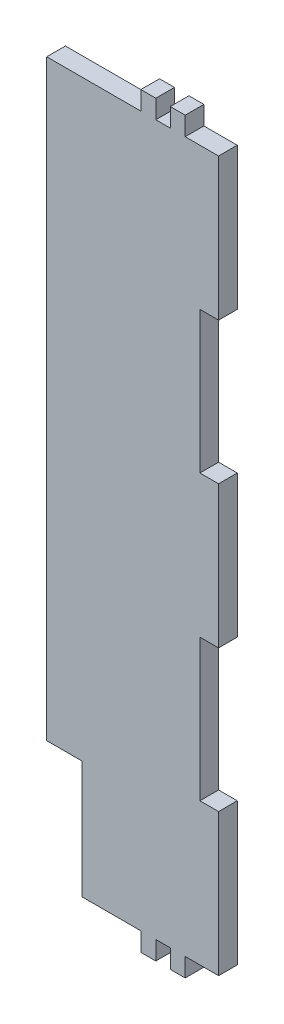
ISO-10303-21;
HEADER;
FILE_DESCRIPTION(('STEP AP214'),'2;1');
FILE_NAME('part.step','',(''),(''),'','','');
FILE_SCHEMA(('AUTOMOTIVE_DESIGN { 1 0 10303 214 1 1 1 1 }'));
ENDSEC;
DATA;
#1=APPLICATION_CONTEXT('core data for automotive mechanical design processes');
#2=APPLICATION_PROTOCOL_DEFINITION('international standard','automotive_design',2000,#1);
#3=PRODUCT_CONTEXT('',#1,'mechanical');
#4=PRODUCT('Part','Part','',(#3));
#5=PRODUCT_RELATED_PRODUCT_CATEGORY('part','',(#4));
#6=PRODUCT_DEFINITION_FORMATION('','',#4);
#7=PRODUCT_DEFINITION_CONTEXT('part definition',#1,'design');
#8=PRODUCT_DEFINITION('design','',#6,#7);
#9=PRODUCT_DEFINITION_SHAPE('','',#8);
#10=(LENGTH_UNIT() NAMED_UNIT(*) SI_UNIT(.MILLI.,.METRE.));
#11=(NAMED_UNIT(*) PLANE_ANGLE_UNIT() SI_UNIT($,.RADIAN.));
#12=(NAMED_UNIT(*) SI_UNIT($,.STERADIAN.) SOLID_ANGLE_UNIT());
#13=UNCERTAINTY_MEASURE_WITH_UNIT(LENGTH_MEASURE(1.E-05),#10,'distance_accuracy_value','');
#14=(GEOMETRIC_REPRESENTATION_CONTEXT(3) GLOBAL_UNCERTAINTY_ASSIGNED_CONTEXT((#13)) GLOBAL_UNIT_ASSIGNED_CONTEXT((#10,
#11,#12)) REPRESENTATION_CONTEXT('',''));
#15=CARTESIAN_POINT('',(0.,0.,0.));
#16=DIRECTION('',(0.,0.,1.));
#17=DIRECTION('',(1.,0.,0.));
#18=AXIS2_PLACEMENT_3D('',#15,#16,#17);
#19=CARTESIAN_POINT('',(-39.54064,-80.70314,-260.737830047496));
#20=DIRECTION('',(0.,-1.,0.));
#21=DIRECTION('',(0.,0.,-1.));
#22=AXIS2_PLACEMENT_3D('',#19,#20,#21);
#23=PLANE('',#22);
#24=DIRECTION('',(-1.,0.,0.));
#25=VECTOR('',#24,1.);
#26=CARTESIAN_POINT('',(-39.54064,-80.70314,0.));
#27=LINE('',#26,#25);
#28=CARTESIAN_POINT('',(-27.54064,-80.70314,0.));
#29=VERTEX_POINT('',#28);
#30=CARTESIAN_POINT('',(-39.54064,-80.70314,0.));
#31=VERTEX_POINT('',#30);
#32=EDGE_CURVE('E46',#29,#31,#27,.T.);
#33=ORIENTED_EDGE('',*,*,#32,.F.);
#34=DIRECTION('',(0.,0.,1.));
#35=VECTOR('',#34,1.);
#36=CARTESIAN_POINT('',(-27.54064,-80.70314,-260.737830047496));
#37=LINE('',#36,#35);
#38=CARTESIAN_POINT('',(-27.54064,-80.70314,6.35));
#39=VERTEX_POINT('',#38);
#40=EDGE_CURVE('E233',#29,#39,#37,.T.);
#41=ORIENTED_EDGE('',*,*,#40,.T.);
#42=DIRECTION('',(1.,0.,0.));
#43=VECTOR('',#42,1.);
#44=CARTESIAN_POINT('',(-39.54064,-80.70314,6.35));
#45=LINE('',#44,#43);
#46=CARTESIAN_POINT('',(-39.54064,-80.70314,6.35));
#47=VERTEX_POINT('',#46);
#48=EDGE_CURVE('E237',#47,#39,#45,.T.);
#49=ORIENTED_EDGE('',*,*,#48,.F.);
#50=DIRECTION('',(0.,0.,1.));
#51=VECTOR('',#50,1.);
#52=CARTESIAN_POINT('',(-39.54064,-80.70314,-260.737830047496));
#53=LINE('',#52,#51);
#54=EDGE_CURVE('E338',#31,#47,#53,.T.);
#55=ORIENTED_EDGE('',*,*,#54,.F.);
#56=EDGE_LOOP('',(#33,#41,#49,#55));
#57=FACE_BOUND('',#56,.T.);
#58=ADVANCED_FACE('F38',(#57),#23,.T.);
#59=CARTESIAN_POINT('',(-39.54064,120.70314,-260.737830047496));
#60=DIRECTION('',(-1.,0.,0.));
#61=DIRECTION('',(0.,-1.,0.));
#62=AXIS2_PLACEMENT_3D('',#59,#60,#61);
#63=PLANE('',#62);
#64=DIRECTION('',(0.,1.,0.));
#65=VECTOR('',#64,1.);
#66=CARTESIAN_POINT('',(-39.54064,120.70314,0.));
#67=LINE('',#66,#65);
#68=CARTESIAN_POINT('',(-39.54064,120.70314,0.));
#69=VERTEX_POINT('',#68);
#70=EDGE_CURVE('E542',#31,#69,#67,.T.);
#71=ORIENTED_EDGE('',*,*,#70,.F.);
#72=ORIENTED_EDGE('',*,*,#54,.T.);
#73=DIRECTION('',(0.,-1.,0.));
#74=VECTOR('',#73,1.);
#75=CARTESIAN_POINT('',(-39.54064,120.70314,6.35));
#76=LINE('',#75,#74);
#77=CARTESIAN_POINT('',(-39.54064,120.70314,6.35));
#78=VERTEX_POINT('',#77);
#79=EDGE_CURVE('E242',#78,#47,#76,.T.);
#80=ORIENTED_EDGE('',*,*,#79,.F.);
#81=DIRECTION('',(0.,0.,1.));
#82=VECTOR('',#81,1.);
#83=CARTESIAN_POINT('',(-39.54064,120.70314,-260.737830047496));
#84=LINE('',#83,#82);
#85=EDGE_CURVE('E341',#69,#78,#84,.T.);
#86=ORIENTED_EDGE('',*,*,#85,.F.);
#87=EDGE_LOOP('',(#71,#72,#80,#86));
#88=FACE_BOUND('',#87,.T.);
#89=ADVANCED_FACE('F541',(#88),#63,.T.);
#90=CARTESIAN_POINT('',(-7.54063999999999,120.70314,-260.737830047496));
#91=DIRECTION('',(0.,1.,0.));
#92=DIRECTION('',(-1.,0.,0.));
#93=AXIS2_PLACEMENT_3D('',#90,#91,#92);
#94=PLANE('',#93);
#95=DIRECTION('',(1.,0.,0.));
#96=VECTOR('',#95,1.);
#97=CARTESIAN_POINT('',(-7.54063999999999,120.70314,0.));
#98=LINE('',#97,#96);
#99=CARTESIAN_POINT('',(-7.54063999999999,120.70314,0.));
#100=VERTEX_POINT('',#99);
#101=EDGE_CURVE('E544',#69,#100,#98,.T.);
#102=ORIENTED_EDGE('',*,*,#101,.F.);
#103=ORIENTED_EDGE('',*,*,#85,.T.);
#104=DIRECTION('',(-1.,0.,0.));
#105=VECTOR('',#104,1.);
#106=CARTESIAN_POINT('',(-7.54063999999999,120.70314,6.35));
#107=LINE('',#106,#105);
#108=CARTESIAN_POINT('',(-7.54063999999999,120.70314,6.35));
#109=VERTEX_POINT('',#108);
#110=EDGE_CURVE('E335',#109,#78,#107,.T.);
#111=ORIENTED_EDGE('',*,*,#110,.F.);
#112=DIRECTION('',(0.,0.,1.));
#113=VECTOR('',#112,1.);
#114=CARTESIAN_POINT('',(-7.54063999999999,120.70314,-260.737830047496));
#115=LINE('',#114,#113);
#116=EDGE_CURVE('E343',#100,#109,#115,.T.);
#117=ORIENTED_EDGE('',*,*,#116,.F.);
#118=EDGE_LOOP('',(#102,#103,#111,#117));
#119=FACE_BOUND('',#118,.T.);
#120=ADVANCED_FACE('F591',(#119),#94,.T.);
#121=CARTESIAN_POINT('',(-7.54063999999999,127.05314,-260.737830047496));
#122=DIRECTION('',(-1.,0.,0.));
#123=DIRECTION('',(0.,0.,1.));
#124=AXIS2_PLACEMENT_3D('',#121,#122,#123);
#125=PLANE('',#124);
#126=DIRECTION('',(0.,1.,0.));
#127=VECTOR('',#126,1.);
#128=CARTESIAN_POINT('',(-7.54063999999999,127.05314,0.));
#129=LINE('',#128,#127);
#130=CARTESIAN_POINT('',(-7.54063999999999,127.05314,0.));
#131=VERTEX_POINT('',#130);
#132=EDGE_CURVE('E545',#100,#131,#129,.T.);
#133=ORIENTED_EDGE('',*,*,#132,.F.);
#134=ORIENTED_EDGE('',*,*,#116,.T.);
#135=DIRECTION('',(0.,-1.,0.));
#136=VECTOR('',#135,1.);
#137=CARTESIAN_POINT('',(-7.54063999999999,127.05314,6.35));
#138=LINE('',#137,#136);
#139=CARTESIAN_POINT('',(-7.54063999999999,127.05314,6.35));
#140=VERTEX_POINT('',#139);
#141=EDGE_CURVE('E332',#140,#109,#138,.T.);
#142=ORIENTED_EDGE('',*,*,#141,.F.);
#143=DIRECTION('',(0.,0.,1.));
#144=VECTOR('',#143,1.);
#145=CARTESIAN_POINT('',(-7.54063999999999,127.05314,-260.737830047496));
#146=LINE('',#145,#144);
#147=EDGE_CURVE('E345',#131,#140,#146,.T.);
#148=ORIENTED_EDGE('',*,*,#147,.F.);
#149=EDGE_LOOP('',(#133,#134,#142,#148));
#150=FACE_BOUND('',#149,.T.);
#151=ADVANCED_FACE('F534',(#150),#125,.T.);
#152=CARTESIAN_POINT('',(-2.45935999999999,127.05314,-260.737830047496));
#153=DIRECTION('',(0.,1.,0.));
#154=DIRECTION('',(-1.,0.,0.));
#155=AXIS2_PLACEMENT_3D('',#152,#153,#154);
#156=PLANE('',#155);
#157=DIRECTION('',(1.,0.,0.));
#158=VECTOR('',#157,1.);
#159=CARTESIAN_POINT('',(-2.45935999999999,127.05314,0.));
#160=LINE('',#159,#158);
#161=CARTESIAN_POINT('',(-2.45935999999999,127.05314,0.));
#162=VERTEX_POINT('',#161);
#163=EDGE_CURVE('E531',#131,#162,#160,.T.);
#164=ORIENTED_EDGE('',*,*,#163,.F.);
#165=ORIENTED_EDGE('',*,*,#147,.T.);
#166=DIRECTION('',(-1.,0.,0.));
#167=VECTOR('',#166,1.);
#168=CARTESIAN_POINT('',(-2.45935999999999,127.05314,6.35));
#169=LINE('',#168,#167);
#170=CARTESIAN_POINT('',(-2.45935999999999,127.05314,6.35));
#171=VERTEX_POINT('',#170);
#172=EDGE_CURVE('E329',#171,#140,#169,.T.);
#173=ORIENTED_EDGE('',*,*,#172,.F.);
#174=DIRECTION('',(0.,0.,1.));
#175=VECTOR('',#174,1.);
#176=CARTESIAN_POINT('',(-2.45935999999999,127.05314,-260.737830047496));
#177=LINE('',#176,#175);
#178=EDGE_CURVE('E347',#162,#171,#177,.T.);
#179=ORIENTED_EDGE('',*,*,#178,.F.);
#180=EDGE_LOOP('',(#164,#165,#173,#179));
#181=FACE_BOUND('',#180,.T.);
#182=ADVANCED_FACE('F528',(#181),#156,.T.);
#183=CARTESIAN_POINT('',(-2.45935999999999,120.70314,-260.737830047496));
#184=DIRECTION('',(1.,0.,0.));
#185=DIRECTION('',(0.,0.,-1.));
#186=AXIS2_PLACEMENT_3D('',#183,#184,#185);
#187=PLANE('',#186);
#188=DIRECTION('',(0.,-1.,0.));
#189=VECTOR('',#188,1.);
#190=CARTESIAN_POINT('',(-2.45935999999999,120.70314,0.));
#191=LINE('',#190,#189);
#192=CARTESIAN_POINT('',(-2.45935999999999,120.70314,0.));
#193=VERTEX_POINT('',#192);
#194=EDGE_CURVE('E525',#162,#193,#191,.T.);
#195=ORIENTED_EDGE('',*,*,#194,.F.);
#196=ORIENTED_EDGE('',*,*,#178,.T.);
#197=DIRECTION('',(0.,1.,0.));
#198=VECTOR('',#197,1.);
#199=CARTESIAN_POINT('',(-2.45935999999999,120.70314,6.35));
#200=LINE('',#199,#198);
#201=CARTESIAN_POINT('',(-2.45935999999999,120.70314,6.35));
#202=VERTEX_POINT('',#201);
#203=EDGE_CURVE('E326',#202,#171,#200,.T.);
#204=ORIENTED_EDGE('',*,*,#203,.F.);
#205=DIRECTION('',(0.,0.,1.));
#206=VECTOR('',#205,1.);
#207=CARTESIAN_POINT('',(-2.45935999999999,120.70314,-260.737830047496));
#208=LINE('',#207,#206);
#209=EDGE_CURVE('E349',#193,#202,#208,.T.);
#210=ORIENTED_EDGE('',*,*,#209,.F.);
#211=EDGE_LOOP('',(#195,#196,#204,#210));
#212=FACE_BOUND('',#211,.T.);
#213=ADVANCED_FACE('F523',(#212),#187,.T.);
#214=CARTESIAN_POINT('',(2.45936000000001,120.70314,-260.737830047496));
#215=DIRECTION('',(0.,1.,0.));
#216=DIRECTION('',(0.,0.,1.));
#217=AXIS2_PLACEMENT_3D('',#214,#215,#216);
#218=PLANE('',#217);
#219=DIRECTION('',(1.,0.,0.));
#220=VECTOR('',#219,1.);
#221=CARTESIAN_POINT('',(2.45936000000001,120.70314,0.));
#222=LINE('',#221,#220);
#223=CARTESIAN_POINT('',(2.45936000000001,120.70314,0.));
#224=VERTEX_POINT('',#223);
#225=EDGE_CURVE('E551',#193,#224,#222,.T.);
#226=ORIENTED_EDGE('',*,*,#225,.F.);
#227=ORIENTED_EDGE('',*,*,#209,.T.);
#228=DIRECTION('',(-1.,0.,0.));
#229=VECTOR('',#228,1.);
#230=CARTESIAN_POINT('',(2.45936000000001,120.70314,6.35));
#231=LINE('',#230,#229);
#232=CARTESIAN_POINT('',(2.45936000000001,120.70314,6.35));
#233=VERTEX_POINT('',#232);
#234=EDGE_CURVE('E323',#233,#202,#231,.T.);
#235=ORIENTED_EDGE('',*,*,#234,.F.);
#236=DIRECTION('',(0.,0.,1.));
#237=VECTOR('',#236,1.);
#238=CARTESIAN_POINT('',(2.45936000000001,120.70314,-260.737830047496));
#239=LINE('',#238,#237);
#240=EDGE_CURVE('E351',#224,#233,#239,.T.);
#241=ORIENTED_EDGE('',*,*,#240,.F.);
#242=EDGE_LOOP('',(#226,#227,#235,#241));
#243=FACE_BOUND('',#242,.T.);
#244=ADVANCED_FACE('F517',(#243),#218,.T.);
#245=CARTESIAN_POINT('',(2.45936000000001,127.05314,-260.737830047496));
#246=DIRECTION('',(-1.,0.,0.));
#247=DIRECTION('',(0.,0.,1.));
#248=AXIS2_PLACEMENT_3D('',#245,#246,#247);
#249=PLANE('',#248);
#250=DIRECTION('',(0.,1.,0.));
#251=VECTOR('',#250,1.);
#252=CARTESIAN_POINT('',(2.45936000000001,127.05314,0.));
#253=LINE('',#252,#251);
#254=CARTESIAN_POINT('',(2.45936000000001,127.05314,0.));
#255=VERTEX_POINT('',#254);
#256=EDGE_CURVE('E514',#224,#255,#253,.T.);
#257=ORIENTED_EDGE('',*,*,#256,.F.);
#258=ORIENTED_EDGE('',*,*,#240,.T.);
#259=DIRECTION('',(0.,-1.,0.));
#260=VECTOR('',#259,1.);
#261=CARTESIAN_POINT('',(2.45936000000001,127.05314,6.35));
#262=LINE('',#261,#260);
#263=CARTESIAN_POINT('',(2.45936000000001,127.05314,6.35));
#264=VERTEX_POINT('',#263);
#265=EDGE_CURVE('E320',#264,#233,#262,.T.);
#266=ORIENTED_EDGE('',*,*,#265,.F.);
#267=DIRECTION('',(0.,0.,1.));
#268=VECTOR('',#267,1.);
#269=CARTESIAN_POINT('',(2.45936000000001,127.05314,-260.737830047496));
#270=LINE('',#269,#268);
#271=EDGE_CURVE('E353',#255,#264,#270,.T.);
#272=ORIENTED_EDGE('',*,*,#271,.F.);
#273=EDGE_LOOP('',(#257,#258,#266,#272));
#274=FACE_BOUND('',#273,.T.);
#275=ADVANCED_FACE('F511',(#274),#249,.T.);
#276=CARTESIAN_POINT('',(7.54064000000001,127.05314,-260.737830047496));
#277=DIRECTION('',(0.,1.,0.));
#278=DIRECTION('',(0.,0.,1.));
#279=AXIS2_PLACEMENT_3D('',#276,#277,#278);
#280=PLANE('',#279);
#281=DIRECTION('',(1.,0.,0.));
#282=VECTOR('',#281,1.);
#283=CARTESIAN_POINT('',(7.54064000000001,127.05314,0.));
#284=LINE('',#283,#282);
#285=CARTESIAN_POINT('',(7.54064000000001,127.05314,0.));
#286=VERTEX_POINT('',#285);
#287=EDGE_CURVE('E508',#255,#286,#284,.T.);
#288=ORIENTED_EDGE('',*,*,#287,.F.);
#289=ORIENTED_EDGE('',*,*,#271,.T.);
#290=DIRECTION('',(-1.,0.,0.));
#291=VECTOR('',#290,1.);
#292=CARTESIAN_POINT('',(7.54064000000001,127.05314,6.35));
#293=LINE('',#292,#291);
#294=CARTESIAN_POINT('',(7.54064000000001,127.05314,6.35));
#295=VERTEX_POINT('',#294);
#296=EDGE_CURVE('E317',#295,#264,#293,.T.);
#297=ORIENTED_EDGE('',*,*,#296,.F.);
#298=DIRECTION('',(0.,0.,1.));
#299=VECTOR('',#298,1.);
#300=CARTESIAN_POINT('',(7.54064000000001,127.05314,-260.737830047496));
#301=LINE('',#300,#299);
#302=EDGE_CURVE('E355',#286,#295,#301,.T.);
#303=ORIENTED_EDGE('',*,*,#302,.F.);
#304=EDGE_LOOP('',(#288,#289,#297,#303));
#305=FACE_BOUND('',#304,.T.);
#306=ADVANCED_FACE('F506',(#305),#280,.T.);
#307=CARTESIAN_POINT('',(7.54064000000001,120.70314,-260.737830047496));
#308=DIRECTION('',(1.,0.,0.));
#309=DIRECTION('',(0.,0.,-1.));
#310=AXIS2_PLACEMENT_3D('',#307,#308,#309);
#311=PLANE('',#310);
#312=DIRECTION('',(0.,-1.,0.));
#313=VECTOR('',#312,1.);
#314=CARTESIAN_POINT('',(7.54064000000001,120.70314,0.));
#315=LINE('',#314,#313);
#316=CARTESIAN_POINT('',(7.54064000000001,120.70314,0.));
#317=VERTEX_POINT('',#316);
#318=EDGE_CURVE('E555',#286,#317,#315,.T.);
#319=ORIENTED_EDGE('',*,*,#318,.F.);
#320=ORIENTED_EDGE('',*,*,#302,.T.);
#321=DIRECTION('',(0.,1.,0.));
#322=VECTOR('',#321,1.);
#323=CARTESIAN_POINT('',(7.54064000000001,120.70314,6.35));
#324=LINE('',#323,#322);
#325=CARTESIAN_POINT('',(7.54064000000001,120.70314,6.35));
#326=VERTEX_POINT('',#325);
#327=EDGE_CURVE('E314',#326,#295,#324,.T.);
#328=ORIENTED_EDGE('',*,*,#327,.F.);
#329=DIRECTION('',(0.,0.,1.));
#330=VECTOR('',#329,1.);
#331=CARTESIAN_POINT('',(7.54064000000001,120.70314,-260.737830047496));
#332=LINE('',#331,#330);
#333=EDGE_CURVE('E357',#317,#326,#332,.T.);
#334=ORIENTED_EDGE('',*,*,#333,.F.);
#335=EDGE_LOOP('',(#319,#320,#328,#334));
#336=FACE_BOUND('',#335,.T.);
#337=ADVANCED_FACE('F500',(#336),#311,.T.);
#338=CARTESIAN_POINT('',(18.89064,120.70314,-260.737830047496));
#339=DIRECTION('',(0.,1.,0.));
#340=DIRECTION('',(0.,0.,1.));
#341=AXIS2_PLACEMENT_3D('',#338,#339,#340);
#342=PLANE('',#341);
#343=DIRECTION('',(1.,0.,0.));
#344=VECTOR('',#343,1.);
#345=CARTESIAN_POINT('',(18.89064,120.70314,0.));
#346=LINE('',#345,#344);
#347=CARTESIAN_POINT('',(18.89064,120.70314,0.));
#348=VERTEX_POINT('',#347);
#349=EDGE_CURVE('E497',#317,#348,#346,.T.);
#350=ORIENTED_EDGE('',*,*,#349,.F.);
#351=ORIENTED_EDGE('',*,*,#333,.T.);
#352=DIRECTION('',(-1.,0.,0.));
#353=VECTOR('',#352,1.);
#354=CARTESIAN_POINT('',(18.89064,120.70314,6.35));
#355=LINE('',#354,#353);
#356=CARTESIAN_POINT('',(18.89064,120.70314,6.35));
#357=VERTEX_POINT('',#356);
#358=EDGE_CURVE('E311',#357,#326,#355,.T.);
#359=ORIENTED_EDGE('',*,*,#358,.F.);
#360=DIRECTION('',(0.,0.,1.));
#361=VECTOR('',#360,1.);
#362=CARTESIAN_POINT('',(18.89064,120.70314,-260.737830047496));
#363=LINE('',#362,#361);
#364=EDGE_CURVE('E359',#348,#357,#363,.T.);
#365=ORIENTED_EDGE('',*,*,#364,.F.);
#366=EDGE_LOOP('',(#350,#351,#359,#365));
#367=FACE_BOUND('',#366,.T.);
#368=ADVANCED_FACE('F494',(#367),#342,.T.);
#369=CARTESIAN_POINT('',(18.89064,72.35686,-260.737830047496));
#370=DIRECTION('',(1.,0.,0.));
#371=DIRECTION('',(0.,1.,0.));
#372=AXIS2_PLACEMENT_3D('',#369,#370,#371);
#373=PLANE('',#372);
#374=DIRECTION('',(0.,-1.,0.));
#375=VECTOR('',#374,1.);
#376=CARTESIAN_POINT('',(18.89064,72.35686,0.));
#377=LINE('',#376,#375);
#378=CARTESIAN_POINT('',(18.89064,72.35686,0.));
#379=VERTEX_POINT('',#378);
#380=EDGE_CURVE('E491',#348,#379,#377,.T.);
#381=ORIENTED_EDGE('',*,*,#380,.F.);
#382=ORIENTED_EDGE('',*,*,#364,.T.);
#383=DIRECTION('',(0.,1.,0.));
#384=VECTOR('',#383,1.);
#385=CARTESIAN_POINT('',(18.89064,72.35686,6.35));
#386=LINE('',#385,#384);
#387=CARTESIAN_POINT('',(18.89064,72.35686,6.35));
#388=VERTEX_POINT('',#387);
#389=EDGE_CURVE('E308',#388,#357,#386,.T.);
#390=ORIENTED_EDGE('',*,*,#389,.F.);
#391=DIRECTION('',(0.,0.,1.));
#392=VECTOR('',#391,1.);
#393=CARTESIAN_POINT('',(18.89064,72.35686,-260.737830047496));
#394=LINE('',#393,#392);
#395=EDGE_CURVE('E361',#379,#388,#394,.T.);
#396=ORIENTED_EDGE('',*,*,#395,.F.);
#397=EDGE_LOOP('',(#381,#382,#390,#396));
#398=FACE_BOUND('',#397,.T.);
#399=ADVANCED_FACE('F489',(#398),#373,.T.);
#400=CARTESIAN_POINT('',(12.54064,72.35686,-260.737830047496));
#401=DIRECTION('',(0.,-1.,0.));
#402=DIRECTION('',(0.,0.,-1.));
#403=AXIS2_PLACEMENT_3D('',#400,#401,#402);
#404=PLANE('',#403);
#405=DIRECTION('',(-1.,0.,0.));
#406=VECTOR('',#405,1.);
#407=CARTESIAN_POINT('',(12.54064,72.35686,0.));
#408=LINE('',#407,#406);
#409=CARTESIAN_POINT('',(12.54064,72.35686,0.));
#410=VERTEX_POINT('',#409);
#411=EDGE_CURVE('E559',#379,#410,#408,.T.);
#412=ORIENTED_EDGE('',*,*,#411,.F.);
#413=ORIENTED_EDGE('',*,*,#395,.T.);
#414=DIRECTION('',(1.,0.,0.));
#415=VECTOR('',#414,1.);
#416=CARTESIAN_POINT('',(12.54064,72.35686,6.35));
#417=LINE('',#416,#415);
#418=CARTESIAN_POINT('',(12.54064,72.35686,6.35));
#419=VERTEX_POINT('',#418);
#420=EDGE_CURVE('E305',#419,#388,#417,.T.);
#421=ORIENTED_EDGE('',*,*,#420,.F.);
#422=DIRECTION('',(0.,0.,1.));
#423=VECTOR('',#422,1.);
#424=CARTESIAN_POINT('',(12.54064,72.35686,-260.737830047496));
#425=LINE('',#424,#423);
#426=EDGE_CURVE('E363',#410,#419,#425,.T.);
#427=ORIENTED_EDGE('',*,*,#426,.F.);
#428=EDGE_LOOP('',(#412,#413,#421,#427));
#429=FACE_BOUND('',#428,.T.);
#430=ADVANCED_FACE('F483',(#429),#404,.T.);
#431=CARTESIAN_POINT('',(12.54064,24.17314,-260.737830047496));
#432=DIRECTION('',(1.,0.,0.));
#433=DIRECTION('',(0.,0.,-1.));
#434=AXIS2_PLACEMENT_3D('',#431,#432,#433);
#435=PLANE('',#434);
#436=DIRECTION('',(0.,-1.,0.));
#437=VECTOR('',#436,1.);
#438=CARTESIAN_POINT('',(12.54064,24.17314,0.));
#439=LINE('',#438,#437);
#440=CARTESIAN_POINT('',(12.54064,24.17314,0.));
#441=VERTEX_POINT('',#440);
#442=EDGE_CURVE('E480',#410,#441,#439,.T.);
#443=ORIENTED_EDGE('',*,*,#442,.F.);
#444=ORIENTED_EDGE('',*,*,#426,.T.);
#445=DIRECTION('',(0.,1.,0.));
#446=VECTOR('',#445,1.);
#447=CARTESIAN_POINT('',(12.54064,24.17314,6.35));
#448=LINE('',#447,#446);
#449=CARTESIAN_POINT('',(12.54064,24.17314,6.35));
#450=VERTEX_POINT('',#449);
#451=EDGE_CURVE('E302',#450,#419,#448,.T.);
#452=ORIENTED_EDGE('',*,*,#451,.F.);
#453=DIRECTION('',(0.,0.,1.));
#454=VECTOR('',#453,1.);
#455=CARTESIAN_POINT('',(12.54064,24.17314,-260.737830047496));
#456=LINE('',#455,#454);
#457=EDGE_CURVE('E365',#441,#450,#456,.T.);
#458=ORIENTED_EDGE('',*,*,#457,.F.);
#459=EDGE_LOOP('',(#443,#444,#452,#458));
#460=FACE_BOUND('',#459,.T.);
#461=ADVANCED_FACE('F477',(#460),#435,.T.);
#462=CARTESIAN_POINT('',(18.89064,24.17314,-260.737830047496));
#463=DIRECTION('',(0.,1.,0.));
#464=DIRECTION('',(0.,0.,1.));
#465=AXIS2_PLACEMENT_3D('',#462,#463,#464);
#466=PLANE('',#465);
#467=DIRECTION('',(1.,0.,0.));
#468=VECTOR('',#467,1.);
#469=CARTESIAN_POINT('',(18.89064,24.17314,0.));
#470=LINE('',#469,#468);
#471=CARTESIAN_POINT('',(18.89064,24.17314,0.));
#472=VERTEX_POINT('',#471);
#473=EDGE_CURVE('E474',#441,#472,#470,.T.);
#474=ORIENTED_EDGE('',*,*,#473,.F.);
#475=ORIENTED_EDGE('',*,*,#457,.T.);
#476=DIRECTION('',(-1.,0.,0.));
#477=VECTOR('',#476,1.);
#478=CARTESIAN_POINT('',(18.89064,24.17314,6.35));
#479=LINE('',#478,#477);
#480=CARTESIAN_POINT('',(18.89064,24.17314,6.35));
#481=VERTEX_POINT('',#480);
#482=EDGE_CURVE('E299',#481,#450,#479,.T.);
#483=ORIENTED_EDGE('',*,*,#482,.F.);
#484=DIRECTION('',(0.,0.,1.));
#485=VECTOR('',#484,1.);
#486=CARTESIAN_POINT('',(18.89064,24.17314,-260.737830047496));
#487=LINE('',#486,#485);
#488=EDGE_CURVE('E367',#472,#481,#487,.T.);
#489=ORIENTED_EDGE('',*,*,#488,.F.);
#490=EDGE_LOOP('',(#474,#475,#483,#489));
#491=FACE_BOUND('',#490,.T.);
#492=ADVANCED_FACE('F472',(#491),#466,.T.);
#493=CARTESIAN_POINT('',(18.89064,-24.17314,-260.737830047496));
#494=DIRECTION('',(1.,0.,0.));
#495=DIRECTION('',(0.,0.,-1.));
#496=AXIS2_PLACEMENT_3D('',#493,#494,#495);
#497=PLANE('',#496);
#498=DIRECTION('',(0.,-1.,0.));
#499=VECTOR('',#498,1.);
#500=CARTESIAN_POINT('',(18.89064,-24.17314,0.));
#501=LINE('',#500,#499);
#502=CARTESIAN_POINT('',(18.89064,-24.17314,0.));
#503=VERTEX_POINT('',#502);
#504=EDGE_CURVE('E563',#472,#503,#501,.T.);
#505=ORIENTED_EDGE('',*,*,#504,.F.);
#506=ORIENTED_EDGE('',*,*,#488,.T.);
#507=DIRECTION('',(0.,1.,0.));
#508=VECTOR('',#507,1.);
#509=CARTESIAN_POINT('',(18.89064,-24.17314,6.35));
#510=LINE('',#509,#508);
#511=CARTESIAN_POINT('',(18.89064,-24.17314,6.35));
#512=VERTEX_POINT('',#511);
#513=EDGE_CURVE('E296',#512,#481,#510,.T.);
#514=ORIENTED_EDGE('',*,*,#513,.F.);
#515=DIRECTION('',(0.,0.,1.));
#516=VECTOR('',#515,1.);
#517=CARTESIAN_POINT('',(18.89064,-24.17314,-260.737830047496));
#518=LINE('',#517,#516);
#519=EDGE_CURVE('E369',#503,#512,#518,.T.);
#520=ORIENTED_EDGE('',*,*,#519,.F.);
#521=EDGE_LOOP('',(#505,#506,#514,#520));
#522=FACE_BOUND('',#521,.T.);
#523=ADVANCED_FACE('F466',(#522),#497,.T.);
#524=CARTESIAN_POINT('',(12.54064,-24.17314,-260.737830047496));
#525=DIRECTION('',(0.,-1.,0.));
#526=DIRECTION('',(0.,0.,-1.));
#527=AXIS2_PLACEMENT_3D('',#524,#525,#526);
#528=PLANE('',#527);
#529=DIRECTION('',(-1.,0.,0.));
#530=VECTOR('',#529,1.);
#531=CARTESIAN_POINT('',(12.54064,-24.17314,0.));
#532=LINE('',#531,#530);
#533=CARTESIAN_POINT('',(12.54064,-24.17314,0.));
#534=VERTEX_POINT('',#533);
#535=EDGE_CURVE('E463',#503,#534,#532,.T.);
#536=ORIENTED_EDGE('',*,*,#535,.F.);
#537=ORIENTED_EDGE('',*,*,#519,.T.);
#538=DIRECTION('',(1.,0.,0.));
#539=VECTOR('',#538,1.);
#540=CARTESIAN_POINT('',(12.54064,-24.17314,6.35));
#541=LINE('',#540,#539);
#542=CARTESIAN_POINT('',(12.54064,-24.17314,6.35));
#543=VERTEX_POINT('',#542);
#544=EDGE_CURVE('E293',#543,#512,#541,.T.);
#545=ORIENTED_EDGE('',*,*,#544,.F.);
#546=DIRECTION('',(0.,0.,1.));
#547=VECTOR('',#546,1.);
#548=CARTESIAN_POINT('',(12.54064,-24.17314,-260.737830047496));
#549=LINE('',#548,#547);
#550=EDGE_CURVE('E371',#534,#543,#549,.T.);
#551=ORIENTED_EDGE('',*,*,#550,.F.);
#552=EDGE_LOOP('',(#536,#537,#545,#551));
#553=FACE_BOUND('',#552,.T.);
#554=ADVANCED_FACE('F460',(#553),#528,.T.);
#555=CARTESIAN_POINT('',(12.54064,-72.35686,-260.737830047496));
#556=DIRECTION('',(1.,0.,0.));
#557=DIRECTION('',(0.,0.,-1.));
#558=AXIS2_PLACEMENT_3D('',#555,#556,#557);
#559=PLANE('',#558);
#560=DIRECTION('',(0.,-1.,0.));
#561=VECTOR('',#560,1.);
#562=CARTESIAN_POINT('',(12.54064,-72.35686,0.));
#563=LINE('',#562,#561);
#564=CARTESIAN_POINT('',(12.54064,-72.35686,0.));
#565=VERTEX_POINT('',#564);
#566=EDGE_CURVE('E457',#534,#565,#563,.T.);
#567=ORIENTED_EDGE('',*,*,#566,.F.);
#568=ORIENTED_EDGE('',*,*,#550,.T.);
#569=DIRECTION('',(0.,1.,0.));
#570=VECTOR('',#569,1.);
#571=CARTESIAN_POINT('',(12.54064,-72.35686,6.35));
#572=LINE('',#571,#570);
#573=CARTESIAN_POINT('',(12.54064,-72.35686,6.35));
#574=VERTEX_POINT('',#573);
#575=EDGE_CURVE('E290',#574,#543,#572,.T.);
#576=ORIENTED_EDGE('',*,*,#575,.F.);
#577=DIRECTION('',(0.,0.,1.));
#578=VECTOR('',#577,1.);
#579=CARTESIAN_POINT('',(12.54064,-72.35686,-260.737830047496));
#580=LINE('',#579,#578);
#581=EDGE_CURVE('E373',#565,#574,#580,.T.);
#582=ORIENTED_EDGE('',*,*,#581,.F.);
#583=EDGE_LOOP('',(#567,#568,#576,#582));
#584=FACE_BOUND('',#583,.T.);
#585=ADVANCED_FACE('F455',(#584),#559,.T.);
#586=CARTESIAN_POINT('',(18.89064,-72.35686,-260.737830047496));
#587=DIRECTION('',(0.,1.,0.));
#588=DIRECTION('',(0.,0.,1.));
#589=AXIS2_PLACEMENT_3D('',#586,#587,#588);
#590=PLANE('',#589);
#591=DIRECTION('',(1.,0.,0.));
#592=VECTOR('',#591,1.);
#593=CARTESIAN_POINT('',(18.89064,-72.35686,0.));
#594=LINE('',#593,#592);
#595=CARTESIAN_POINT('',(18.89064,-72.35686,0.));
#596=VERTEX_POINT('',#595);
#597=EDGE_CURVE('E567',#565,#596,#594,.T.);
#598=ORIENTED_EDGE('',*,*,#597,.F.);
#599=ORIENTED_EDGE('',*,*,#581,.T.);
#600=DIRECTION('',(-1.,0.,0.));
#601=VECTOR('',#600,1.);
#602=CARTESIAN_POINT('',(18.89064,-72.35686,6.35));
#603=LINE('',#602,#601);
#604=CARTESIAN_POINT('',(18.89064,-72.35686,6.35));
#605=VERTEX_POINT('',#604);
#606=EDGE_CURVE('E287',#605,#574,#603,.T.);
#607=ORIENTED_EDGE('',*,*,#606,.F.);
#608=DIRECTION('',(0.,0.,1.));
#609=VECTOR('',#608,1.);
#610=CARTESIAN_POINT('',(18.89064,-72.35686,-260.737830047496));
#611=LINE('',#610,#609);
#612=EDGE_CURVE('E375',#596,#605,#611,.T.);
#613=ORIENTED_EDGE('',*,*,#612,.F.);
#614=EDGE_LOOP('',(#598,#599,#607,#613));
#615=FACE_BOUND('',#614,.T.);
#616=ADVANCED_FACE('F449',(#615),#590,.T.);
#617=CARTESIAN_POINT('',(18.89064,-120.70314,-260.737830047496));
#618=DIRECTION('',(1.,0.,0.));
#619=DIRECTION('',(0.,0.,-1.));
#620=AXIS2_PLACEMENT_3D('',#617,#618,#619);
#621=PLANE('',#620);
#622=DIRECTION('',(0.,-1.,0.));
#623=VECTOR('',#622,1.);
#624=CARTESIAN_POINT('',(18.89064,-120.70314,0.));
#625=LINE('',#624,#623);
#626=CARTESIAN_POINT('',(18.89064,-120.70314,0.));
#627=VERTEX_POINT('',#626);
#628=EDGE_CURVE('E446',#596,#627,#625,.T.);
#629=ORIENTED_EDGE('',*,*,#628,.F.);
#630=ORIENTED_EDGE('',*,*,#612,.T.);
#631=DIRECTION('',(0.,1.,0.));
#632=VECTOR('',#631,1.);
#633=CARTESIAN_POINT('',(18.89064,-120.70314,6.35));
#634=LINE('',#633,#632);
#635=CARTESIAN_POINT('',(18.89064,-120.70314,6.35));
#636=VERTEX_POINT('',#635);
#637=EDGE_CURVE('E284',#636,#605,#634,.T.);
#638=ORIENTED_EDGE('',*,*,#637,.F.);
#639=DIRECTION('',(0.,0.,1.));
#640=VECTOR('',#639,1.);
#641=CARTESIAN_POINT('',(18.89064,-120.70314,-260.737830047496));
#642=LINE('',#641,#640);
#643=EDGE_CURVE('E377',#627,#636,#642,.T.);
#644=ORIENTED_EDGE('',*,*,#643,.F.);
#645=EDGE_LOOP('',(#629,#630,#638,#644));
#646=FACE_BOUND('',#645,.T.);
#647=ADVANCED_FACE('F443',(#646),#621,.T.);
#648=CARTESIAN_POINT('',(7.54064000000001,-120.70314,-260.737830047496));
#649=DIRECTION('',(0.,-1.,0.));
#650=DIRECTION('',(1.,0.,0.));
#651=AXIS2_PLACEMENT_3D('',#648,#649,#650);
#652=PLANE('',#651);
#653=DIRECTION('',(-1.,0.,0.));
#654=VECTOR('',#653,1.);
#655=CARTESIAN_POINT('',(7.54064000000001,-120.70314,0.));
#656=LINE('',#655,#654);
#657=CARTESIAN_POINT('',(7.54064000000001,-120.70314,0.));
#658=VERTEX_POINT('',#657);
#659=EDGE_CURVE('E440',#627,#658,#656,.T.);
#660=ORIENTED_EDGE('',*,*,#659,.F.);
#661=ORIENTED_EDGE('',*,*,#643,.T.);
#662=DIRECTION('',(1.,0.,0.));
#663=VECTOR('',#662,1.);
#664=CARTESIAN_POINT('',(7.54064000000001,-120.70314,6.35));
#665=LINE('',#664,#663);
#666=CARTESIAN_POINT('',(7.54064000000001,-120.70314,6.35));
#667=VERTEX_POINT('',#666);
#668=EDGE_CURVE('E281',#667,#636,#665,.T.);
#669=ORIENTED_EDGE('',*,*,#668,.F.);
#670=DIRECTION('',(0.,0.,1.));
#671=VECTOR('',#670,1.);
#672=CARTESIAN_POINT('',(7.54064000000001,-120.70314,-260.737830047496));
#673=LINE('',#672,#671);
#674=EDGE_CURVE('E379',#658,#667,#673,.T.);
#675=ORIENTED_EDGE('',*,*,#674,.F.);
#676=EDGE_LOOP('',(#660,#661,#669,#675));
#677=FACE_BOUND('',#676,.T.);
#678=ADVANCED_FACE('F438',(#677),#652,.T.);
#679=CARTESIAN_POINT('',(7.54064000000001,-127.05314,-260.737830047496));
#680=DIRECTION('',(1.,0.,0.));
#681=DIRECTION('',(0.,0.,-1.));
#682=AXIS2_PLACEMENT_3D('',#679,#680,#681);
#683=PLANE('',#682);
#684=DIRECTION('',(0.,-1.,0.));
#685=VECTOR('',#684,1.);
#686=CARTESIAN_POINT('',(7.54064000000001,-127.05314,0.));
#687=LINE('',#686,#685);
#688=CARTESIAN_POINT('',(7.54064000000001,-127.05314,0.));
#689=VERTEX_POINT('',#688);
#690=EDGE_CURVE('E571',#658,#689,#687,.T.);
#691=ORIENTED_EDGE('',*,*,#690,.F.);
#692=ORIENTED_EDGE('',*,*,#674,.T.);
#693=DIRECTION('',(0.,1.,0.));
#694=VECTOR('',#693,1.);
#695=CARTESIAN_POINT('',(7.54064000000001,-127.05314,6.35));
#696=LINE('',#695,#694);
#697=CARTESIAN_POINT('',(7.54064000000001,-127.05314,6.35));
#698=VERTEX_POINT('',#697);
#699=EDGE_CURVE('E278',#698,#667,#696,.T.);
#700=ORIENTED_EDGE('',*,*,#699,.F.);
#701=DIRECTION('',(0.,0.,1.));
#702=VECTOR('',#701,1.);
#703=CARTESIAN_POINT('',(7.54064000000001,-127.05314,-260.737830047496));
#704=LINE('',#703,#702);
#705=EDGE_CURVE('E381',#689,#698,#704,.T.);
#706=ORIENTED_EDGE('',*,*,#705,.F.);
#707=EDGE_LOOP('',(#691,#692,#700,#706));
#708=FACE_BOUND('',#707,.T.);
#709=ADVANCED_FACE('F432',(#708),#683,.T.);
#710=CARTESIAN_POINT('',(2.45936000000001,-127.05314,-260.737830047496));
#711=DIRECTION('',(0.,-1.,0.));
#712=DIRECTION('',(1.,0.,0.));
#713=AXIS2_PLACEMENT_3D('',#710,#711,#712);
#714=PLANE('',#713);
#715=DIRECTION('',(-1.,0.,0.));
#716=VECTOR('',#715,1.);
#717=CARTESIAN_POINT('',(2.45936000000001,-127.05314,0.));
#718=LINE('',#717,#716);
#719=CARTESIAN_POINT('',(2.45936000000001,-127.05314,0.));
#720=VERTEX_POINT('',#719);
#721=EDGE_CURVE('E429',#689,#720,#718,.T.);
#722=ORIENTED_EDGE('',*,*,#721,.F.);
#723=ORIENTED_EDGE('',*,*,#705,.T.);
#724=DIRECTION('',(1.,0.,0.));
#725=VECTOR('',#724,1.);
#726=CARTESIAN_POINT('',(2.45936000000001,-127.05314,6.35));
#727=LINE('',#726,#725);
#728=CARTESIAN_POINT('',(2.45936000000001,-127.05314,6.35));
#729=VERTEX_POINT('',#728);
#730=EDGE_CURVE('E275',#729,#698,#727,.T.);
#731=ORIENTED_EDGE('',*,*,#730,.F.);
#732=DIRECTION('',(0.,0.,1.));
#733=VECTOR('',#732,1.);
#734=CARTESIAN_POINT('',(2.45936000000001,-127.05314,-260.737830047496));
#735=LINE('',#734,#733);
#736=EDGE_CURVE('E383',#720,#729,#735,.T.);
#737=ORIENTED_EDGE('',*,*,#736,.F.);
#738=EDGE_LOOP('',(#722,#723,#731,#737));
#739=FACE_BOUND('',#738,.T.);
#740=ADVANCED_FACE('F426',(#739),#714,.T.);
#741=CARTESIAN_POINT('',(2.45936000000001,-120.70314,-260.737830047496));
#742=DIRECTION('',(-1.,0.,0.));
#743=DIRECTION('',(0.,0.,1.));
#744=AXIS2_PLACEMENT_3D('',#741,#742,#743);
#745=PLANE('',#744);
#746=DIRECTION('',(0.,1.,0.));
#747=VECTOR('',#746,1.);
#748=CARTESIAN_POINT('',(2.45936000000001,-120.70314,0.));
#749=LINE('',#748,#747);
#750=CARTESIAN_POINT('',(2.45936000000001,-120.70314,0.));
#751=VERTEX_POINT('',#750);
#752=EDGE_CURVE('E423',#720,#751,#749,.T.);
#753=ORIENTED_EDGE('',*,*,#752,.F.);
#754=ORIENTED_EDGE('',*,*,#736,.T.);
#755=DIRECTION('',(0.,-1.,0.));
#756=VECTOR('',#755,1.);
#757=CARTESIAN_POINT('',(2.45936000000001,-120.70314,6.35));
#758=LINE('',#757,#756);
#759=CARTESIAN_POINT('',(2.45936000000001,-120.70314,6.35));
#760=VERTEX_POINT('',#759);
#761=EDGE_CURVE('E272',#760,#729,#758,.T.);
#762=ORIENTED_EDGE('',*,*,#761,.F.);
#763=DIRECTION('',(0.,0.,1.));
#764=VECTOR('',#763,1.);
#765=CARTESIAN_POINT('',(2.45936000000001,-120.70314,-260.737830047496));
#766=LINE('',#765,#764);
#767=EDGE_CURVE('E385',#751,#760,#766,.T.);
#768=ORIENTED_EDGE('',*,*,#767,.F.);
#769=EDGE_LOOP('',(#753,#754,#762,#768));
#770=FACE_BOUND('',#769,.T.);
#771=ADVANCED_FACE('F421',(#770),#745,.T.);
#772=CARTESIAN_POINT('',(-2.45935999999999,-120.70314,-260.737830047496));
#773=DIRECTION('',(0.,-1.,0.));
#774=DIRECTION('',(0.,0.,-1.));
#775=AXIS2_PLACEMENT_3D('',#772,#773,#774);
#776=PLANE('',#775);
#777=DIRECTION('',(-1.,0.,0.));
#778=VECTOR('',#777,1.);
#779=CARTESIAN_POINT('',(-2.45935999999999,-120.70314,0.));
#780=LINE('',#779,#778);
#781=CARTESIAN_POINT('',(-2.45935999999999,-120.70314,0.));
#782=VERTEX_POINT('',#781);
#783=EDGE_CURVE('E575',#751,#782,#780,.T.);
#784=ORIENTED_EDGE('',*,*,#783,.F.);
#785=ORIENTED_EDGE('',*,*,#767,.T.);
#786=DIRECTION('',(1.,0.,0.));
#787=VECTOR('',#786,1.);
#788=CARTESIAN_POINT('',(-2.45935999999999,-120.70314,6.35));
#789=LINE('',#788,#787);
#790=CARTESIAN_POINT('',(-2.45935999999999,-120.70314,6.35));
#791=VERTEX_POINT('',#790);
#792=EDGE_CURVE('E269',#791,#760,#789,.T.);
#793=ORIENTED_EDGE('',*,*,#792,.F.);
#794=DIRECTION('',(0.,0.,1.));
#795=VECTOR('',#794,1.);
#796=CARTESIAN_POINT('',(-2.45935999999999,-120.70314,-260.737830047496));
#797=LINE('',#796,#795);
#798=EDGE_CURVE('E387',#782,#791,#797,.T.);
#799=ORIENTED_EDGE('',*,*,#798,.F.);
#800=EDGE_LOOP('',(#784,#785,#793,#799));
#801=FACE_BOUND('',#800,.T.);
#802=ADVANCED_FACE('F415',(#801),#776,.T.);
#803=CARTESIAN_POINT('',(-2.45935999999999,-127.05314,-260.737830047496));
#804=DIRECTION('',(1.,0.,0.));
#805=DIRECTION('',(0.,0.,-1.));
#806=AXIS2_PLACEMENT_3D('',#803,#804,#805);
#807=PLANE('',#806);
#808=DIRECTION('',(0.,-1.,0.));
#809=VECTOR('',#808,1.);
#810=CARTESIAN_POINT('',(-2.45935999999999,-127.05314,0.));
#811=LINE('',#810,#809);
#812=CARTESIAN_POINT('',(-2.45935999999999,-127.05314,0.));
#813=VERTEX_POINT('',#812);
#814=EDGE_CURVE('E412',#782,#813,#811,.T.);
#815=ORIENTED_EDGE('',*,*,#814,.F.);
#816=ORIENTED_EDGE('',*,*,#798,.T.);
#817=DIRECTION('',(0.,1.,0.));
#818=VECTOR('',#817,1.);
#819=CARTESIAN_POINT('',(-2.45935999999999,-127.05314,6.35));
#820=LINE('',#819,#818);
#821=CARTESIAN_POINT('',(-2.45935999999999,-127.05314,6.35));
#822=VERTEX_POINT('',#821);
#823=EDGE_CURVE('E266',#822,#791,#820,.T.);
#824=ORIENTED_EDGE('',*,*,#823,.F.);
#825=DIRECTION('',(0.,0.,1.));
#826=VECTOR('',#825,1.);
#827=CARTESIAN_POINT('',(-2.45935999999999,-127.05314,-260.737830047496));
#828=LINE('',#827,#826);
#829=EDGE_CURVE('E389',#813,#822,#828,.T.);
#830=ORIENTED_EDGE('',*,*,#829,.F.);
#831=EDGE_LOOP('',(#815,#816,#824,#830));
#832=FACE_BOUND('',#831,.T.);
#833=ADVANCED_FACE('F409',(#832),#807,.T.);
#834=CARTESIAN_POINT('',(-7.54063999999999,-127.05314,-260.737830047496));
#835=DIRECTION('',(0.,-1.,0.));
#836=DIRECTION('',(1.,0.,0.));
#837=AXIS2_PLACEMENT_3D('',#834,#835,#836);
#838=PLANE('',#837);
#839=DIRECTION('',(-1.,0.,0.));
#840=VECTOR('',#839,1.);
#841=CARTESIAN_POINT('',(-7.54063999999999,-127.05314,0.));
#842=LINE('',#841,#840);
#843=CARTESIAN_POINT('',(-7.54063999999999,-127.05314,0.));
#844=VERTEX_POINT('',#843);
#845=EDGE_CURVE('E58',#813,#844,#842,.T.);
#846=ORIENTED_EDGE('',*,*,#845,.F.);
#847=ORIENTED_EDGE('',*,*,#829,.T.);
#848=DIRECTION('',(1.,0.,0.));
#849=VECTOR('',#848,1.);
#850=CARTESIAN_POINT('',(-7.54063999999999,-127.05314,6.35));
#851=LINE('',#850,#849);
#852=CARTESIAN_POINT('',(-7.54063999999999,-127.05314,6.35));
#853=VERTEX_POINT('',#852);
#854=EDGE_CURVE('E263',#853,#822,#851,.T.);
#855=ORIENTED_EDGE('',*,*,#854,.F.);
#856=DIRECTION('',(0.,0.,1.));
#857=VECTOR('',#856,1.);
#858=CARTESIAN_POINT('',(-7.54063999999999,-127.05314,-260.737830047496));
#859=LINE('',#858,#857);
#860=EDGE_CURVE('E391',#844,#853,#859,.T.);
#861=ORIENTED_EDGE('',*,*,#860,.F.);
#862=EDGE_LOOP('',(#846,#847,#855,#861));
#863=FACE_BOUND('',#862,.T.);
#864=ADVANCED_FACE('F405',(#863),#838,.T.);
#865=CARTESIAN_POINT('',(-7.54063999999999,-120.70314,-260.737830047496));
#866=DIRECTION('',(-1.,0.,0.));
#867=DIRECTION('',(0.,0.,1.));
#868=AXIS2_PLACEMENT_3D('',#865,#866,#867);
#869=PLANE('',#868);
#870=DIRECTION('',(0.,1.,0.));
#871=VECTOR('',#870,1.);
#872=CARTESIAN_POINT('',(-7.54063999999999,-120.70314,0.));
#873=LINE('',#872,#871);
#874=CARTESIAN_POINT('',(-7.54063999999999,-120.70314,0.));
#875=VERTEX_POINT('',#874);
#876=EDGE_CURVE('E53',#844,#875,#873,.T.);
#877=ORIENTED_EDGE('',*,*,#876,.F.);
#878=ORIENTED_EDGE('',*,*,#860,.T.);
#879=DIRECTION('',(0.,-1.,0.));
#880=VECTOR('',#879,1.);
#881=CARTESIAN_POINT('',(-7.54063999999999,-120.70314,6.35));
#882=LINE('',#881,#880);
#883=CARTESIAN_POINT('',(-7.54063999999999,-120.70314,6.35));
#884=VERTEX_POINT('',#883);
#885=EDGE_CURVE('E260',#884,#853,#882,.T.);
#886=ORIENTED_EDGE('',*,*,#885,.F.);
#887=DIRECTION('',(0.,0.,1.));
#888=VECTOR('',#887,1.);
#889=CARTESIAN_POINT('',(-7.54063999999999,-120.70314,-260.737830047496));
#890=LINE('',#889,#888);
#891=EDGE_CURVE('E393',#875,#884,#890,.T.);
#892=ORIENTED_EDGE('',*,*,#891,.F.);
#893=EDGE_LOOP('',(#877,#878,#886,#892));
#894=FACE_BOUND('',#893,.T.);
#895=ADVANCED_FACE('F400',(#894),#869,.T.);
#896=CARTESIAN_POINT('',(-27.54064,-120.70314,-260.737830047496));
#897=DIRECTION('',(0.,-1.,0.));
#898=DIRECTION('',(0.,0.,-1.));
#899=AXIS2_PLACEMENT_3D('',#896,#897,#898);
#900=PLANE('',#899);
#901=DIRECTION('',(-1.,0.,0.));
#902=VECTOR('',#901,1.);
#903=CARTESIAN_POINT('',(-27.54064,-120.70314,0.));
#904=LINE('',#903,#902);
#905=CARTESIAN_POINT('',(-27.54064,-120.70314,0.));
#906=VERTEX_POINT('',#905);
#907=EDGE_CURVE('E340',#875,#906,#904,.T.);
#908=ORIENTED_EDGE('',*,*,#907,.F.);
#909=ORIENTED_EDGE('',*,*,#891,.T.);
#910=DIRECTION('',(1.,0.,0.));
#911=VECTOR('',#910,1.);
#912=CARTESIAN_POINT('',(-27.54064,-120.70314,6.35));
#913=LINE('',#912,#911);
#914=CARTESIAN_POINT('',(-27.54064,-120.70314,6.35));
#915=VERTEX_POINT('',#914);
#916=EDGE_CURVE('E250',#915,#884,#913,.T.);
#917=ORIENTED_EDGE('',*,*,#916,.F.);
#918=DIRECTION('',(0.,0.,1.));
#919=VECTOR('',#918,1.);
#920=CARTESIAN_POINT('',(-27.54064,-120.70314,-260.737830047496));
#921=LINE('',#920,#919);
#922=EDGE_CURVE('E241',#906,#915,#921,.T.);
#923=ORIENTED_EDGE('',*,*,#922,.F.);
#924=EDGE_LOOP('',(#908,#909,#917,#923));
#925=FACE_BOUND('',#924,.T.);
#926=ADVANCED_FACE('F398',(#925),#900,.T.);
#927=CARTESIAN_POINT('',(-27.54064,-80.70314,-260.737830047496));
#928=DIRECTION('',(-1.,0.,0.));
#929=DIRECTION('',(0.,0.,1.));
#930=AXIS2_PLACEMENT_3D('',#927,#928,#929);
#931=PLANE('',#930);
#932=DIRECTION('',(0.,1.,0.));
#933=VECTOR('',#932,1.);
#934=CARTESIAN_POINT('',(-27.54064,-80.70314,0.));
#935=LINE('',#934,#933);
#936=EDGE_CURVE('E11',#906,#29,#935,.T.);
#937=ORIENTED_EDGE('',*,*,#936,.F.);
#938=ORIENTED_EDGE('',*,*,#922,.T.);
#939=DIRECTION('',(0.,-1.,0.));
#940=VECTOR('',#939,1.);
#941=CARTESIAN_POINT('',(-27.54064,-80.70314,6.35));
#942=LINE('',#941,#940);
#943=EDGE_CURVE('E244',#39,#915,#942,.T.);
#944=ORIENTED_EDGE('',*,*,#943,.F.);
#945=ORIENTED_EDGE('',*,*,#40,.F.);
#946=EDGE_LOOP('',(#937,#938,#944,#945));
#947=FACE_BOUND('',#946,.T.);
#948=ADVANCED_FACE('F245',(#947),#931,.T.);
#949=CARTESIAN_POINT('',(0.,0.,0.));
#950=DIRECTION('',(0.,0.,1.));
#951=DIRECTION('',(1.,0.,0.));
#952=AXIS2_PLACEMENT_3D('',#949,#950,#951);
#953=PLANE('',#952);
#954=ORIENTED_EDGE('',*,*,#32,.T.);
#955=ORIENTED_EDGE('',*,*,#70,.T.);
#956=ORIENTED_EDGE('',*,*,#101,.T.);
#957=ORIENTED_EDGE('',*,*,#132,.T.);
#958=ORIENTED_EDGE('',*,*,#163,.T.);
#959=ORIENTED_EDGE('',*,*,#194,.T.);
#960=ORIENTED_EDGE('',*,*,#225,.T.);
#961=ORIENTED_EDGE('',*,*,#256,.T.);
#962=ORIENTED_EDGE('',*,*,#287,.T.);
#963=ORIENTED_EDGE('',*,*,#318,.T.);
#964=ORIENTED_EDGE('',*,*,#349,.T.);
#965=ORIENTED_EDGE('',*,*,#380,.T.);
#966=ORIENTED_EDGE('',*,*,#411,.T.);
#967=ORIENTED_EDGE('',*,*,#442,.T.);
#968=ORIENTED_EDGE('',*,*,#473,.T.);
#969=ORIENTED_EDGE('',*,*,#504,.T.);
#970=ORIENTED_EDGE('',*,*,#535,.T.);
#971=ORIENTED_EDGE('',*,*,#566,.T.);
#972=ORIENTED_EDGE('',*,*,#597,.T.);
#973=ORIENTED_EDGE('',*,*,#628,.T.);
#974=ORIENTED_EDGE('',*,*,#659,.T.);
#975=ORIENTED_EDGE('',*,*,#690,.T.);
#976=ORIENTED_EDGE('',*,*,#721,.T.);
#977=ORIENTED_EDGE('',*,*,#752,.T.);
#978=ORIENTED_EDGE('',*,*,#783,.T.);
#979=ORIENTED_EDGE('',*,*,#814,.T.);
#980=ORIENTED_EDGE('',*,*,#845,.T.);
#981=ORIENTED_EDGE('',*,*,#876,.T.);
#982=ORIENTED_EDGE('',*,*,#907,.T.);
#983=ORIENTED_EDGE('',*,*,#936,.T.);
#984=EDGE_LOOP('',(#954,#955,#956,#957,#958,#959,#960,#961,#962,#963,#964,#965,#966,#967,#968,
#969,#970,#971,#972,#973,#974,#975,#976,#977,#978,#979,#980,#981,#982,#983));
#985=FACE_BOUND('',#984,.T.);
#986=ADVANCED_FACE('F40',(#985),#953,.F.);
#987=CARTESIAN_POINT('',(0.,0.,6.35));
#988=DIRECTION('',(0.,0.,1.));
#989=DIRECTION('',(1.,0.,0.));
#990=AXIS2_PLACEMENT_3D('',#987,#988,#989);
#991=PLANE('',#990);
#992=ORIENTED_EDGE('',*,*,#48,.T.);
#993=ORIENTED_EDGE('',*,*,#943,.T.);
#994=ORIENTED_EDGE('',*,*,#916,.T.);
#995=ORIENTED_EDGE('',*,*,#885,.T.);
#996=ORIENTED_EDGE('',*,*,#854,.T.);
#997=ORIENTED_EDGE('',*,*,#823,.T.);
#998=ORIENTED_EDGE('',*,*,#792,.T.);
#999=ORIENTED_EDGE('',*,*,#761,.T.);
#1000=ORIENTED_EDGE('',*,*,#730,.T.);
#1001=ORIENTED_EDGE('',*,*,#699,.T.);
#1002=ORIENTED_EDGE('',*,*,#668,.T.);
#1003=ORIENTED_EDGE('',*,*,#637,.T.);
#1004=ORIENTED_EDGE('',*,*,#606,.T.);
#1005=ORIENTED_EDGE('',*,*,#575,.T.);
#1006=ORIENTED_EDGE('',*,*,#544,.T.);
#1007=ORIENTED_EDGE('',*,*,#513,.T.);
#1008=ORIENTED_EDGE('',*,*,#482,.T.);
#1009=ORIENTED_EDGE('',*,*,#451,.T.);
#1010=ORIENTED_EDGE('',*,*,#420,.T.);
#1011=ORIENTED_EDGE('',*,*,#389,.T.);
#1012=ORIENTED_EDGE('',*,*,#358,.T.);
#1013=ORIENTED_EDGE('',*,*,#327,.T.);
#1014=ORIENTED_EDGE('',*,*,#296,.T.);
#1015=ORIENTED_EDGE('',*,*,#265,.T.);
#1016=ORIENTED_EDGE('',*,*,#234,.T.);
#1017=ORIENTED_EDGE('',*,*,#203,.T.);
#1018=ORIENTED_EDGE('',*,*,#172,.T.);
#1019=ORIENTED_EDGE('',*,*,#141,.T.);
#1020=ORIENTED_EDGE('',*,*,#110,.T.);
#1021=ORIENTED_EDGE('',*,*,#79,.T.);
#1022=EDGE_LOOP('',(#992,#993,#994,#995,#996,#997,#998,#999,#1000,#1001,#1002,#1003,#1004,#1005,
#1006,#1007,#1008,#1009,#1010,#1011,#1012,#1013,#1014,#1015,#1016,#1017,#1018,#1019,#1020,#1021));
#1023=FACE_BOUND('',#1022,.T.);
#1024=ADVANCED_FACE('F252',(#1023),#991,.T.);
#1025=CLOSED_SHELL('',(#58,#89,#120,#151,#182,#213,#244,#275,#306,#337,#368,#399,#430,#461,#492,
#523,#554,#585,#616,#647,#678,#709,#740,#771,#802,#833,#864,#895,#926,#948,#986,#1024));
#1026=MANIFOLD_SOLID_BREP('B2',#1025);
#1027=ADVANCED_BREP_SHAPE_REPRESENTATION('',(#18,#1026),#14);
#1028=SHAPE_DEFINITION_REPRESENTATION(#9,#1027);
ENDSEC;
END-ISO-10303-21;
